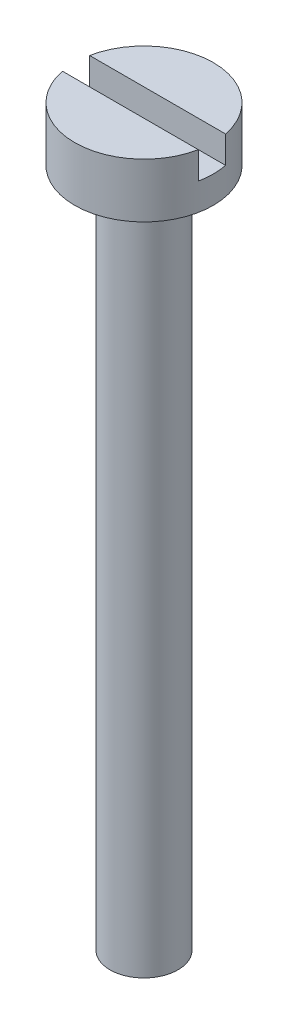
ISO-10303-21;
HEADER;
FILE_DESCRIPTION(('STEP AP214'),'2;1');
FILE_NAME('part.step','',(''),(''),'','','');
FILE_SCHEMA(('AUTOMOTIVE_DESIGN { 1 0 10303 214 1 1 1 1 }'));
ENDSEC;
DATA;
#1=APPLICATION_CONTEXT('core data for automotive mechanical design processes');
#2=APPLICATION_PROTOCOL_DEFINITION('international standard','automotive_design',2000,#1);
#3=PRODUCT_CONTEXT('',#1,'mechanical');
#4=PRODUCT('Part','Part','',(#3));
#5=PRODUCT_RELATED_PRODUCT_CATEGORY('part','',(#4));
#6=PRODUCT_DEFINITION_FORMATION('','',#4);
#7=PRODUCT_DEFINITION_CONTEXT('part definition',#1,'design');
#8=PRODUCT_DEFINITION('design','',#6,#7);
#9=PRODUCT_DEFINITION_SHAPE('','',#8);
#10=(LENGTH_UNIT() NAMED_UNIT(*) SI_UNIT(.MILLI.,.METRE.));
#11=(NAMED_UNIT(*) PLANE_ANGLE_UNIT() SI_UNIT($,.RADIAN.));
#12=(NAMED_UNIT(*) SI_UNIT($,.STERADIAN.) SOLID_ANGLE_UNIT());
#13=UNCERTAINTY_MEASURE_WITH_UNIT(LENGTH_MEASURE(1.E-05),#10,'distance_accuracy_value','');
#14=(GEOMETRIC_REPRESENTATION_CONTEXT(3) GLOBAL_UNCERTAINTY_ASSIGNED_CONTEXT((#13)) GLOBAL_UNIT_ASSIGNED_CONTEXT((#10,
#11,#12)) REPRESENTATION_CONTEXT('',''));
#15=CARTESIAN_POINT('',(0.,0.,0.));
#16=DIRECTION('',(0.,0.,1.));
#17=DIRECTION('',(1.,0.,0.));
#18=AXIS2_PLACEMENT_3D('',#15,#16,#17);
#19=CARTESIAN_POINT('',(0.,2.,0.));
#20=DIRECTION('',(0.,1.,0.));
#21=DIRECTION('',(0.,0.,1.));
#22=AXIS2_PLACEMENT_3D('',#19,#20,#21);
#23=PLANE('',#22);
#24=DIRECTION('',(1.,0.,0.));
#25=VECTOR('',#24,1.);
#26=CARTESIAN_POINT('',(0.,2.,0.5));
#27=LINE('',#26,#25);
#28=CARTESIAN_POINT('',(-2.50049995001,2.,0.5));
#29=VERTEX_POINT('',#28);
#30=CARTESIAN_POINT('',(2.50049995001,2.,0.5));
#31=VERTEX_POINT('',#30);
#32=EDGE_CURVE('E82',#29,#31,#27,.T.);
#33=ORIENTED_EDGE('',*,*,#32,.F.);
#34=CARTESIAN_POINT('',(0.,2.,0.));
#35=DIRECTION('',(0.,1.,0.));
#36=DIRECTION('',(0.,0.,1.));
#37=AXIS2_PLACEMENT_3D('',#34,#35,#36);
#38=CIRCLE('',#37,2.55);
#39=EDGE_CURVE('E92',#29,#31,#38,.T.);
#40=ORIENTED_EDGE('',*,*,#39,.T.);
#41=EDGE_LOOP('',(#33,#40));
#42=FACE_BOUND('',#41,.T.);
#43=ADVANCED_FACE('F34',(#42),#23,.T.);
#44=CARTESIAN_POINT('',(0.,2.,0.));
#45=DIRECTION('',(0.,-1.,0.));
#46=DIRECTION('',(0.,0.,-1.));
#47=AXIS2_PLACEMENT_3D('',#44,#45,#46);
#48=CYLINDRICAL_SURFACE('',#47,2.55);
#49=CARTESIAN_POINT('',(0.,1.,0.));
#50=DIRECTION('',(0.,-1.,0.));
#51=DIRECTION('',(0.,0.,-1.));
#52=AXIS2_PLACEMENT_3D('',#49,#50,#51);
#53=CIRCLE('',#52,2.55);
#54=CARTESIAN_POINT('',(2.50049995001,1.,-0.5));
#55=VERTEX_POINT('',#54);
#56=CARTESIAN_POINT('',(2.50049995001,1.,0.5));
#57=VERTEX_POINT('',#56);
#58=EDGE_CURVE('E11',#55,#57,#53,.T.);
#59=ORIENTED_EDGE('',*,*,#58,.T.);
#60=DIRECTION('',(0.,-1.,0.));
#61=VECTOR('',#60,1.);
#62=CARTESIAN_POINT('',(2.50049995001,2.,0.5));
#63=LINE('',#62,#61);
#64=EDGE_CURVE('E57',#57,#31,#63,.F.);
#65=ORIENTED_EDGE('',*,*,#64,.T.);
#66=ORIENTED_EDGE('',*,*,#39,.F.);
#67=DIRECTION('',(0.,-1.,0.));
#68=VECTOR('',#67,1.);
#69=CARTESIAN_POINT('',(-2.50049995001,2.,0.5));
#70=LINE('',#69,#68);
#71=CARTESIAN_POINT('',(-2.50049995001,1.,0.5));
#72=VERTEX_POINT('',#71);
#73=EDGE_CURVE('E104',#29,#72,#70,.T.);
#74=ORIENTED_EDGE('',*,*,#73,.T.);
#75=CARTESIAN_POINT('',(-2.50049995001,1.,-0.5));
#76=VERTEX_POINT('',#75);
#77=EDGE_CURVE('E38',#72,#76,#53,.T.);
#78=ORIENTED_EDGE('',*,*,#77,.T.);
#79=DIRECTION('',(0.,-1.,0.));
#80=VECTOR('',#79,1.);
#81=CARTESIAN_POINT('',(-2.50049995001,2.,-0.5));
#82=LINE('',#81,#80);
#83=CARTESIAN_POINT('',(-2.50049995001,2.,-0.5));
#84=VERTEX_POINT('',#83);
#85=EDGE_CURVE('E77',#76,#84,#82,.F.);
#86=ORIENTED_EDGE('',*,*,#85,.T.);
#87=CARTESIAN_POINT('',(2.50049995001,2.,-0.5));
#88=VERTEX_POINT('',#87);
#89=EDGE_CURVE('E83',#88,#84,#38,.T.);
#90=ORIENTED_EDGE('',*,*,#89,.F.);
#91=DIRECTION('',(0.,-1.,0.));
#92=VECTOR('',#91,1.);
#93=CARTESIAN_POINT('',(2.50049995001,2.,-0.5));
#94=LINE('',#93,#92);
#95=EDGE_CURVE('E49',#88,#55,#94,.T.);
#96=ORIENTED_EDGE('',*,*,#95,.T.);
#97=EDGE_LOOP('',(#59,#65,#66,#74,#78,#86,#90,#96));
#98=FACE_BOUND('',#97,.T.);
#99=CARTESIAN_POINT('',(0.,0.,0.));
#100=DIRECTION('',(0.,1.,0.));
#101=DIRECTION('',(0.,0.,1.));
#102=AXIS2_PLACEMENT_3D('',#99,#100,#101);
#103=CIRCLE('',#102,2.55);
#104=CARTESIAN_POINT('',(0.,0.,2.55));
#105=VERTEX_POINT('',#104);
#106=EDGE_CURVE('E95',#105,#105,#103,.T.);
#107=ORIENTED_EDGE('',*,*,#106,.T.);
#108=EDGE_LOOP('',(#107));
#109=FACE_BOUND('',#108,.T.);
#110=ADVANCED_FACE('F36',(#98,#109),#48,.T.);
#111=DIRECTION('',(-1.,0.,0.));
#112=VECTOR('',#111,1.);
#113=CARTESIAN_POINT('',(0.,2.,-0.5));
#114=LINE('',#113,#112);
#115=EDGE_CURVE('E74',#88,#84,#114,.T.);
#116=ORIENTED_EDGE('',*,*,#115,.F.);
#117=ORIENTED_EDGE('',*,*,#89,.T.);
#118=EDGE_LOOP('',(#116,#117));
#119=FACE_BOUND('',#118,.T.);
#120=ADVANCED_FACE('F91',(#119),#23,.T.);
#121=CARTESIAN_POINT('',(0.,0.,0.));
#122=DIRECTION('',(0.,1.,0.));
#123=DIRECTION('',(0.,0.,1.));
#124=AXIS2_PLACEMENT_3D('',#121,#122,#123);
#125=PLANE('',#124);
#126=CARTESIAN_POINT('',(0.,0.,0.));
#127=DIRECTION('',(0.,1.,0.));
#128=DIRECTION('',(0.,0.,1.));
#129=AXIS2_PLACEMENT_3D('',#126,#127,#128);
#130=CIRCLE('',#129,1.25);
#131=CARTESIAN_POINT('',(0.,0.,1.25));
#132=VERTEX_POINT('',#131);
#133=EDGE_CURVE('E98',#132,#132,#130,.T.);
#134=ORIENTED_EDGE('',*,*,#133,.T.);
#135=EDGE_LOOP('',(#134));
#136=FACE_BOUND('',#135,.T.);
#137=ORIENTED_EDGE('',*,*,#106,.F.);
#138=EDGE_LOOP('',(#137));
#139=FACE_BOUND('',#138,.T.);
#140=ADVANCED_FACE('F115',(#136,#139),#125,.F.);
#141=CARTESIAN_POINT('',(0.,-25.,0.));
#142=DIRECTION('',(0.,1.,0.));
#143=DIRECTION('',(0.,0.,1.));
#144=AXIS2_PLACEMENT_3D('',#141,#142,#143);
#145=CYLINDRICAL_SURFACE('',#144,1.25);
#146=CARTESIAN_POINT('',(0.,-25.,0.));
#147=DIRECTION('',(0.,1.,0.));
#148=DIRECTION('',(0.,0.,1.));
#149=AXIS2_PLACEMENT_3D('',#146,#147,#148);
#150=CIRCLE('',#149,1.25);
#151=CARTESIAN_POINT('',(0.,-25.,1.25));
#152=VERTEX_POINT('',#151);
#153=EDGE_CURVE('E101',#152,#152,#150,.T.);
#154=ORIENTED_EDGE('',*,*,#153,.T.);
#155=EDGE_LOOP('',(#154));
#156=FACE_BOUND('',#155,.T.);
#157=ORIENTED_EDGE('',*,*,#133,.F.);
#158=EDGE_LOOP('',(#157));
#159=FACE_BOUND('',#158,.T.);
#160=ADVANCED_FACE('F119',(#156,#159),#145,.T.);
#161=CARTESIAN_POINT('',(0.,-25.,0.));
#162=DIRECTION('',(0.,1.,0.));
#163=DIRECTION('',(0.,0.,1.));
#164=AXIS2_PLACEMENT_3D('',#161,#162,#163);
#165=PLANE('',#164);
#166=ORIENTED_EDGE('',*,*,#153,.F.);
#167=EDGE_LOOP('',(#166));
#168=FACE_BOUND('',#167,.T.);
#169=ADVANCED_FACE('F124',(#168),#165,.F.);
#170=CARTESIAN_POINT('',(0.,1.,0.));
#171=DIRECTION('',(0.,-1.,0.));
#172=DIRECTION('',(0.,0.,-1.));
#173=AXIS2_PLACEMENT_3D('',#170,#171,#172);
#174=PLANE('',#173);
#175=DIRECTION('',(-1.,0.,0.));
#176=VECTOR('',#175,1.);
#177=CARTESIAN_POINT('',(-3.,1.,-0.5));
#178=LINE('',#177,#176);
#179=EDGE_CURVE('E136',#55,#76,#178,.T.);
#180=ORIENTED_EDGE('',*,*,#179,.T.);
#181=ORIENTED_EDGE('',*,*,#77,.F.);
#182=DIRECTION('',(1.,0.,0.));
#183=VECTOR('',#182,1.);
#184=CARTESIAN_POINT('',(-3.,1.,0.5));
#185=LINE('',#184,#183);
#186=EDGE_CURVE('E89',#72,#57,#185,.T.);
#187=ORIENTED_EDGE('',*,*,#186,.T.);
#188=ORIENTED_EDGE('',*,*,#58,.F.);
#189=EDGE_LOOP('',(#180,#181,#187,#188));
#190=FACE_BOUND('',#189,.T.);
#191=ADVANCED_FACE('F138',(#190),#174,.F.);
#192=CARTESIAN_POINT('',(-3.,1.,0.5));
#193=DIRECTION('',(0.,0.,1.));
#194=DIRECTION('',(1.,0.,0.));
#195=AXIS2_PLACEMENT_3D('',#192,#193,#194);
#196=PLANE('',#195);
#197=ORIENTED_EDGE('',*,*,#32,.T.);
#198=ORIENTED_EDGE('',*,*,#64,.F.);
#199=ORIENTED_EDGE('',*,*,#186,.F.);
#200=ORIENTED_EDGE('',*,*,#73,.F.);
#201=EDGE_LOOP('',(#197,#198,#199,#200));
#202=FACE_BOUND('',#201,.T.);
#203=ADVANCED_FACE('F103',(#202),#196,.F.);
#204=CARTESIAN_POINT('',(-3.,1.,-0.5));
#205=DIRECTION('',(0.,0.,-1.));
#206=DIRECTION('',(-1.,0.,0.));
#207=AXIS2_PLACEMENT_3D('',#204,#205,#206);
#208=PLANE('',#207);
#209=ORIENTED_EDGE('',*,*,#115,.T.);
#210=ORIENTED_EDGE('',*,*,#85,.F.);
#211=ORIENTED_EDGE('',*,*,#179,.F.);
#212=ORIENTED_EDGE('',*,*,#95,.F.);
#213=EDGE_LOOP('',(#209,#210,#211,#212));
#214=FACE_BOUND('',#213,.T.);
#215=ADVANCED_FACE('F76',(#214),#208,.F.);
#216=CLOSED_SHELL('',(#43,#110,#120,#140,#160,#169,#191,#203,#215));
#217=MANIFOLD_SOLID_BREP('B2',#216);
#218=ADVANCED_BREP_SHAPE_REPRESENTATION('',(#18,#217),#14);
#219=SHAPE_DEFINITION_REPRESENTATION(#9,#218);
ENDSEC;
END-ISO-10303-21;
